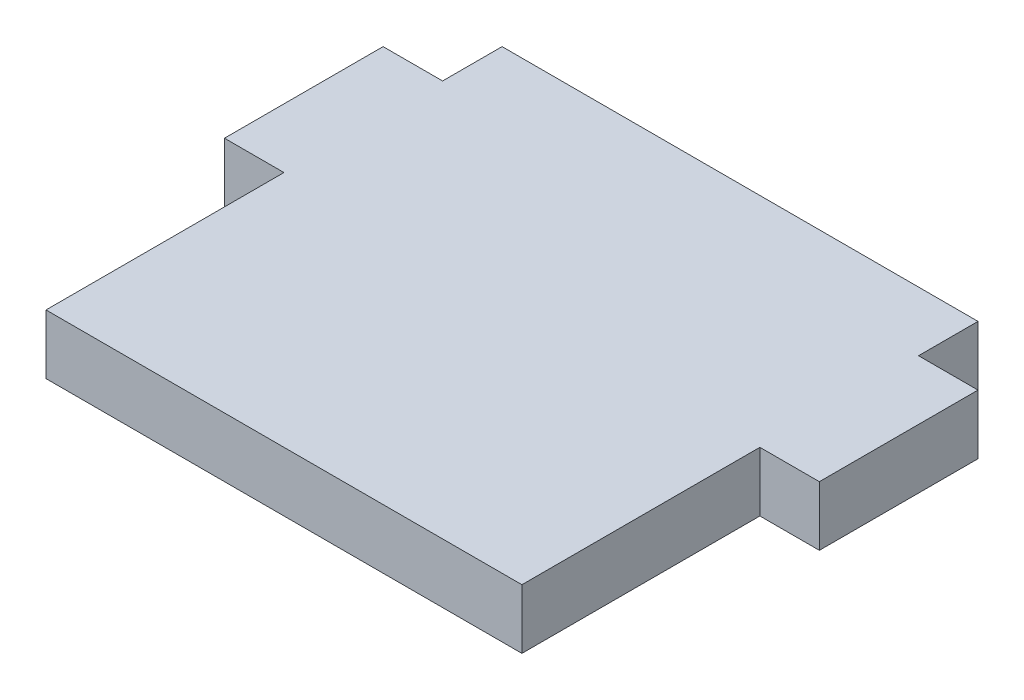
ISO-10303-21;
HEADER;
FILE_DESCRIPTION(('STEP AP214'),'2;1');
FILE_NAME('part.step','',(''),(''),'','','');
FILE_SCHEMA(('AUTOMOTIVE_DESIGN { 1 0 10303 214 1 1 1 1 }'));
ENDSEC;
DATA;
#1=APPLICATION_CONTEXT('core data for automotive mechanical design processes');
#2=APPLICATION_PROTOCOL_DEFINITION('international standard','automotive_design',2000,#1);
#3=PRODUCT_CONTEXT('',#1,'mechanical');
#4=PRODUCT('Part','Part','',(#3));
#5=PRODUCT_RELATED_PRODUCT_CATEGORY('part','',(#4));
#6=PRODUCT_DEFINITION_FORMATION('','',#4);
#7=PRODUCT_DEFINITION_CONTEXT('part definition',#1,'design');
#8=PRODUCT_DEFINITION('design','',#6,#7);
#9=PRODUCT_DEFINITION_SHAPE('','',#8);
#10=(LENGTH_UNIT() NAMED_UNIT(*) SI_UNIT(.MILLI.,.METRE.));
#11=(NAMED_UNIT(*) PLANE_ANGLE_UNIT() SI_UNIT($,.RADIAN.));
#12=(NAMED_UNIT(*) SI_UNIT($,.STERADIAN.) SOLID_ANGLE_UNIT());
#13=UNCERTAINTY_MEASURE_WITH_UNIT(LENGTH_MEASURE(1.E-05),#10,'distance_accuracy_value','');
#14=(GEOMETRIC_REPRESENTATION_CONTEXT(3) GLOBAL_UNCERTAINTY_ASSIGNED_CONTEXT((#13)) GLOBAL_UNIT_ASSIGNED_CONTEXT((#10,
#11,#12)) REPRESENTATION_CONTEXT('',''));
#15=CARTESIAN_POINT('',(0.,0.,0.));
#16=DIRECTION('',(0.,0.,1.));
#17=DIRECTION('',(1.,0.,0.));
#18=AXIS2_PLACEMENT_3D('',#15,#16,#17);
#19=CARTESIAN_POINT('',(0.,19.05,-76.2));
#20=DIRECTION('',(1.,0.,0.));
#21=DIRECTION('',(0.,0.,-1.));
#22=AXIS2_PLACEMENT_3D('',#19,#20,#21);
#23=PLANE('',#22);
#24=DIRECTION('',(0.,0.,1.));
#25=VECTOR('',#24,1.);
#26=CARTESIAN_POINT('',(0.,0.,-76.2));
#27=LINE('',#26,#25);
#28=CARTESIAN_POINT('',(0.,0.,-76.2));
#29=VERTEX_POINT('',#28);
#30=CARTESIAN_POINT('',(0.,0.,0.));
#31=VERTEX_POINT('',#30);
#32=EDGE_CURVE('E155',#29,#31,#27,.T.);
#33=ORIENTED_EDGE('',*,*,#32,.T.);
#34=DIRECTION('',(0.,-1.,0.));
#35=VECTOR('',#34,1.);
#36=CARTESIAN_POINT('',(0.,19.05,0.));
#37=LINE('',#36,#35);
#38=CARTESIAN_POINT('',(0.,19.05,0.));
#39=VERTEX_POINT('',#38);
#40=EDGE_CURVE('E11',#39,#31,#37,.T.);
#41=ORIENTED_EDGE('',*,*,#40,.F.);
#42=DIRECTION('',(0.,0.,1.));
#43=VECTOR('',#42,1.);
#44=CARTESIAN_POINT('',(0.,19.05,-76.2));
#45=LINE('',#44,#43);
#46=CARTESIAN_POINT('',(0.,19.05,-76.2));
#47=VERTEX_POINT('',#46);
#48=EDGE_CURVE('E177',#47,#39,#45,.T.);
#49=ORIENTED_EDGE('',*,*,#48,.F.);
#50=DIRECTION('',(0.,-1.,0.));
#51=VECTOR('',#50,1.);
#52=CARTESIAN_POINT('',(0.,19.05,-76.2));
#53=LINE('',#52,#51);
#54=EDGE_CURVE('E151',#47,#29,#53,.T.);
#55=ORIENTED_EDGE('',*,*,#54,.T.);
#56=EDGE_LOOP('',(#33,#41,#49,#55));
#57=FACE_BOUND('',#56,.T.);
#58=ADVANCED_FACE('F35',(#57),#23,.F.);
#59=CARTESIAN_POINT('',(0.,19.05,0.));
#60=DIRECTION('',(0.,0.,-1.));
#61=DIRECTION('',(-1.,0.,0.));
#62=AXIS2_PLACEMENT_3D('',#59,#60,#61);
#63=PLANE('',#62);
#64=DIRECTION('',(1.,0.,0.));
#65=VECTOR('',#64,1.);
#66=CARTESIAN_POINT('',(0.,0.,0.));
#67=LINE('',#66,#65);
#68=CARTESIAN_POINT('',(152.4,0.,0.));
#69=VERTEX_POINT('',#68);
#70=EDGE_CURVE('E158',#31,#69,#67,.T.);
#71=ORIENTED_EDGE('',*,*,#70,.T.);
#72=DIRECTION('',(0.,-1.,0.));
#73=VECTOR('',#72,1.);
#74=CARTESIAN_POINT('',(152.4,19.05,0.));
#75=LINE('',#74,#73);
#76=CARTESIAN_POINT('',(152.4,19.05,0.));
#77=VERTEX_POINT('',#76);
#78=EDGE_CURVE('E43',#77,#69,#75,.T.);
#79=ORIENTED_EDGE('',*,*,#78,.F.);
#80=DIRECTION('',(1.,0.,0.));
#81=VECTOR('',#80,1.);
#82=CARTESIAN_POINT('',(0.,19.05,0.));
#83=LINE('',#82,#81);
#84=EDGE_CURVE('E106',#39,#77,#83,.T.);
#85=ORIENTED_EDGE('',*,*,#84,.F.);
#86=ORIENTED_EDGE('',*,*,#40,.T.);
#87=EDGE_LOOP('',(#71,#79,#85,#86));
#88=FACE_BOUND('',#87,.T.);
#89=ADVANCED_FACE('F255',(#88),#63,.F.);
#90=CARTESIAN_POINT('',(152.4,19.05,0.));
#91=DIRECTION('',(-1.,0.,0.));
#92=DIRECTION('',(0.,0.,1.));
#93=AXIS2_PLACEMENT_3D('',#90,#91,#92);
#94=PLANE('',#93);
#95=DIRECTION('',(0.,0.,-1.));
#96=VECTOR('',#95,1.);
#97=CARTESIAN_POINT('',(152.4,0.,0.));
#98=LINE('',#97,#96);
#99=CARTESIAN_POINT('',(152.4,0.,-76.2));
#100=VERTEX_POINT('',#99);
#101=EDGE_CURVE('E160',#69,#100,#98,.T.);
#102=ORIENTED_EDGE('',*,*,#101,.T.);
#103=DIRECTION('',(0.,-1.,0.));
#104=VECTOR('',#103,1.);
#105=CARTESIAN_POINT('',(152.4,19.05,-76.2));
#106=LINE('',#105,#104);
#107=CARTESIAN_POINT('',(152.4,19.05,-76.2));
#108=VERTEX_POINT('',#107);
#109=EDGE_CURVE('E196',#108,#100,#106,.T.);
#110=ORIENTED_EDGE('',*,*,#109,.F.);
#111=DIRECTION('',(0.,0.,-1.));
#112=VECTOR('',#111,1.);
#113=CARTESIAN_POINT('',(152.4,19.05,0.));
#114=LINE('',#113,#112);
#115=EDGE_CURVE('E204',#77,#108,#114,.T.);
#116=ORIENTED_EDGE('',*,*,#115,.F.);
#117=ORIENTED_EDGE('',*,*,#78,.T.);
#118=EDGE_LOOP('',(#102,#110,#116,#117));
#119=FACE_BOUND('',#118,.T.);
#120=ADVANCED_FACE('F202',(#119),#94,.F.);
#121=CARTESIAN_POINT('',(152.4,19.05,-76.2));
#122=DIRECTION('',(0.,0.,-1.));
#123=DIRECTION('',(-1.,0.,0.));
#124=AXIS2_PLACEMENT_3D('',#121,#122,#123);
#125=PLANE('',#124);
#126=DIRECTION('',(1.,0.,0.));
#127=VECTOR('',#126,1.);
#128=CARTESIAN_POINT('',(152.4,0.,-76.2));
#129=LINE('',#128,#127);
#130=CARTESIAN_POINT('',(171.45,0.,-76.2));
#131=VERTEX_POINT('',#130);
#132=EDGE_CURVE('E162',#100,#131,#129,.T.);
#133=ORIENTED_EDGE('',*,*,#132,.T.);
#134=DIRECTION('',(0.,-1.,0.));
#135=VECTOR('',#134,1.);
#136=CARTESIAN_POINT('',(171.45,19.05,-76.2));
#137=LINE('',#136,#135);
#138=CARTESIAN_POINT('',(171.45,19.05,-76.2));
#139=VERTEX_POINT('',#138);
#140=EDGE_CURVE('E193',#139,#131,#137,.T.);
#141=ORIENTED_EDGE('',*,*,#140,.F.);
#142=DIRECTION('',(1.,0.,0.));
#143=VECTOR('',#142,1.);
#144=CARTESIAN_POINT('',(152.4,19.05,-76.2));
#145=LINE('',#144,#143);
#146=EDGE_CURVE('E222',#108,#139,#145,.T.);
#147=ORIENTED_EDGE('',*,*,#146,.F.);
#148=ORIENTED_EDGE('',*,*,#109,.T.);
#149=EDGE_LOOP('',(#133,#141,#147,#148));
#150=FACE_BOUND('',#149,.T.);
#151=ADVANCED_FACE('F213',(#150),#125,.F.);
#152=CARTESIAN_POINT('',(171.45,19.05,-76.2));
#153=DIRECTION('',(-1.,0.,0.));
#154=DIRECTION('',(0.,0.,1.));
#155=AXIS2_PLACEMENT_3D('',#152,#153,#154);
#156=PLANE('',#155);
#157=DIRECTION('',(0.,0.,-1.));
#158=VECTOR('',#157,1.);
#159=CARTESIAN_POINT('',(171.45,0.,-76.2));
#160=LINE('',#159,#158);
#161=CARTESIAN_POINT('',(171.45,0.,-127.));
#162=VERTEX_POINT('',#161);
#163=EDGE_CURVE('E164',#131,#162,#160,.T.);
#164=ORIENTED_EDGE('',*,*,#163,.T.);
#165=DIRECTION('',(0.,-1.,0.));
#166=VECTOR('',#165,1.);
#167=CARTESIAN_POINT('',(171.45,19.05,-127.));
#168=LINE('',#167,#166);
#169=CARTESIAN_POINT('',(171.45,19.05,-127.));
#170=VERTEX_POINT('',#169);
#171=EDGE_CURVE('E190',#170,#162,#168,.T.);
#172=ORIENTED_EDGE('',*,*,#171,.F.);
#173=DIRECTION('',(0.,0.,-1.));
#174=VECTOR('',#173,1.);
#175=CARTESIAN_POINT('',(171.45,19.05,-76.2));
#176=LINE('',#175,#174);
#177=EDGE_CURVE('E219',#139,#170,#176,.T.);
#178=ORIENTED_EDGE('',*,*,#177,.F.);
#179=ORIENTED_EDGE('',*,*,#140,.T.);
#180=EDGE_LOOP('',(#164,#172,#178,#179));
#181=FACE_BOUND('',#180,.T.);
#182=ADVANCED_FACE('F217',(#181),#156,.F.);
#183=CARTESIAN_POINT('',(171.45,19.05,-127.));
#184=DIRECTION('',(0.,0.,1.));
#185=DIRECTION('',(1.,0.,0.));
#186=AXIS2_PLACEMENT_3D('',#183,#184,#185);
#187=PLANE('',#186);
#188=DIRECTION('',(-1.,0.,0.));
#189=VECTOR('',#188,1.);
#190=CARTESIAN_POINT('',(171.45,0.,-127.));
#191=LINE('',#190,#189);
#192=CARTESIAN_POINT('',(152.4,0.,-127.));
#193=VERTEX_POINT('',#192);
#194=EDGE_CURVE('E166',#162,#193,#191,.T.);
#195=ORIENTED_EDGE('',*,*,#194,.T.);
#196=DIRECTION('',(0.,-1.,0.));
#197=VECTOR('',#196,1.);
#198=CARTESIAN_POINT('',(152.4,19.05,-127.));
#199=LINE('',#198,#197);
#200=CARTESIAN_POINT('',(152.4,19.05,-127.));
#201=VERTEX_POINT('',#200);
#202=EDGE_CURVE('E187',#201,#193,#199,.T.);
#203=ORIENTED_EDGE('',*,*,#202,.F.);
#204=DIRECTION('',(-1.,0.,0.));
#205=VECTOR('',#204,1.);
#206=CARTESIAN_POINT('',(171.45,19.05,-127.));
#207=LINE('',#206,#205);
#208=EDGE_CURVE('E221',#170,#201,#207,.T.);
#209=ORIENTED_EDGE('',*,*,#208,.F.);
#210=ORIENTED_EDGE('',*,*,#171,.T.);
#211=EDGE_LOOP('',(#195,#203,#209,#210));
#212=FACE_BOUND('',#211,.T.);
#213=ADVANCED_FACE('F268',(#212),#187,.F.);
#214=CARTESIAN_POINT('',(152.4,19.05,-127.));
#215=DIRECTION('',(-1.,0.,0.));
#216=DIRECTION('',(0.,0.,1.));
#217=AXIS2_PLACEMENT_3D('',#214,#215,#216);
#218=PLANE('',#217);
#219=DIRECTION('',(0.,0.,-1.));
#220=VECTOR('',#219,1.);
#221=CARTESIAN_POINT('',(152.4,0.,-127.));
#222=LINE('',#221,#220);
#223=CARTESIAN_POINT('',(152.4,0.,-146.05));
#224=VERTEX_POINT('',#223);
#225=EDGE_CURVE('E168',#193,#224,#222,.T.);
#226=ORIENTED_EDGE('',*,*,#225,.T.);
#227=DIRECTION('',(0.,-1.,0.));
#228=VECTOR('',#227,1.);
#229=CARTESIAN_POINT('',(152.4,19.05,-146.05));
#230=LINE('',#229,#228);
#231=CARTESIAN_POINT('',(152.4,19.05,-146.05));
#232=VERTEX_POINT('',#231);
#233=EDGE_CURVE('E184',#232,#224,#230,.T.);
#234=ORIENTED_EDGE('',*,*,#233,.F.);
#235=DIRECTION('',(0.,0.,-1.));
#236=VECTOR('',#235,1.);
#237=CARTESIAN_POINT('',(152.4,19.05,-127.));
#238=LINE('',#237,#236);
#239=EDGE_CURVE('E224',#201,#232,#238,.T.);
#240=ORIENTED_EDGE('',*,*,#239,.F.);
#241=ORIENTED_EDGE('',*,*,#202,.T.);
#242=EDGE_LOOP('',(#226,#234,#240,#241));
#243=FACE_BOUND('',#242,.T.);
#244=ADVANCED_FACE('F271',(#243),#218,.F.);
#245=CARTESIAN_POINT('',(152.4,19.05,-146.05));
#246=DIRECTION('',(0.,0.,1.));
#247=DIRECTION('',(1.,0.,0.));
#248=AXIS2_PLACEMENT_3D('',#245,#246,#247);
#249=PLANE('',#248);
#250=DIRECTION('',(-1.,0.,0.));
#251=VECTOR('',#250,1.);
#252=CARTESIAN_POINT('',(152.4,0.,-146.05));
#253=LINE('',#252,#251);
#254=CARTESIAN_POINT('',(0.,0.,-146.05));
#255=VERTEX_POINT('',#254);
#256=EDGE_CURVE('E170',#224,#255,#253,.T.);
#257=ORIENTED_EDGE('',*,*,#256,.T.);
#258=DIRECTION('',(0.,-1.,0.));
#259=VECTOR('',#258,1.);
#260=CARTESIAN_POINT('',(0.,19.05,-146.05));
#261=LINE('',#260,#259);
#262=CARTESIAN_POINT('',(0.,19.05,-146.05));
#263=VERTEX_POINT('',#262);
#264=EDGE_CURVE('E181',#263,#255,#261,.T.);
#265=ORIENTED_EDGE('',*,*,#264,.F.);
#266=DIRECTION('',(-1.,0.,0.));
#267=VECTOR('',#266,1.);
#268=CARTESIAN_POINT('',(152.4,19.05,-146.05));
#269=LINE('',#268,#267);
#270=EDGE_CURVE('E230',#232,#263,#269,.T.);
#271=ORIENTED_EDGE('',*,*,#270,.F.);
#272=ORIENTED_EDGE('',*,*,#233,.T.);
#273=EDGE_LOOP('',(#257,#265,#271,#272));
#274=FACE_BOUND('',#273,.T.);
#275=ADVANCED_FACE('F236',(#274),#249,.F.);
#276=CARTESIAN_POINT('',(0.,19.05,-146.05));
#277=DIRECTION('',(1.,0.,0.));
#278=DIRECTION('',(0.,0.,-1.));
#279=AXIS2_PLACEMENT_3D('',#276,#277,#278);
#280=PLANE('',#279);
#281=DIRECTION('',(0.,0.,1.));
#282=VECTOR('',#281,1.);
#283=CARTESIAN_POINT('',(0.,0.,-146.05));
#284=LINE('',#283,#282);
#285=CARTESIAN_POINT('',(0.,0.,-127.));
#286=VERTEX_POINT('',#285);
#287=EDGE_CURVE('E172',#255,#286,#284,.T.);
#288=ORIENTED_EDGE('',*,*,#287,.T.);
#289=DIRECTION('',(0.,-1.,0.));
#290=VECTOR('',#289,1.);
#291=CARTESIAN_POINT('',(0.,19.05,-127.));
#292=LINE('',#291,#290);
#293=CARTESIAN_POINT('',(0.,19.05,-127.));
#294=VERTEX_POINT('',#293);
#295=EDGE_CURVE('E146',#294,#286,#292,.T.);
#296=ORIENTED_EDGE('',*,*,#295,.F.);
#297=DIRECTION('',(0.,0.,1.));
#298=VECTOR('',#297,1.);
#299=CARTESIAN_POINT('',(0.,19.05,-146.05));
#300=LINE('',#299,#298);
#301=EDGE_CURVE('E137',#263,#294,#300,.T.);
#302=ORIENTED_EDGE('',*,*,#301,.F.);
#303=ORIENTED_EDGE('',*,*,#264,.T.);
#304=EDGE_LOOP('',(#288,#296,#302,#303));
#305=FACE_BOUND('',#304,.T.);
#306=ADVANCED_FACE('F240',(#305),#280,.F.);
#307=CARTESIAN_POINT('',(0.,19.05,-127.));
#308=DIRECTION('',(0.,0.,1.));
#309=DIRECTION('',(1.,0.,0.));
#310=AXIS2_PLACEMENT_3D('',#307,#308,#309);
#311=PLANE('',#310);
#312=DIRECTION('',(-1.,0.,0.));
#313=VECTOR('',#312,1.);
#314=CARTESIAN_POINT('',(0.,0.,-127.));
#315=LINE('',#314,#313);
#316=CARTESIAN_POINT('',(-19.05,0.,-127.));
#317=VERTEX_POINT('',#316);
#318=EDGE_CURVE('E145',#286,#317,#315,.T.);
#319=ORIENTED_EDGE('',*,*,#318,.T.);
#320=DIRECTION('',(0.,-1.,0.));
#321=VECTOR('',#320,1.);
#322=CARTESIAN_POINT('',(-19.05,19.05,-127.));
#323=LINE('',#322,#321);
#324=CARTESIAN_POINT('',(-19.05,19.05,-127.));
#325=VERTEX_POINT('',#324);
#326=EDGE_CURVE('E142',#325,#317,#323,.T.);
#327=ORIENTED_EDGE('',*,*,#326,.F.);
#328=DIRECTION('',(-1.,0.,0.));
#329=VECTOR('',#328,1.);
#330=CARTESIAN_POINT('',(0.,19.05,-127.));
#331=LINE('',#330,#329);
#332=EDGE_CURVE('E131',#294,#325,#331,.T.);
#333=ORIENTED_EDGE('',*,*,#332,.F.);
#334=ORIENTED_EDGE('',*,*,#295,.T.);
#335=EDGE_LOOP('',(#319,#327,#333,#334));
#336=FACE_BOUND('',#335,.T.);
#337=ADVANCED_FACE('F143',(#336),#311,.F.);
#338=CARTESIAN_POINT('',(-19.05,19.05,-127.));
#339=DIRECTION('',(1.,0.,0.));
#340=DIRECTION('',(0.,0.,-1.));
#341=AXIS2_PLACEMENT_3D('',#338,#339,#340);
#342=PLANE('',#341);
#343=DIRECTION('',(0.,0.,1.));
#344=VECTOR('',#343,1.);
#345=CARTESIAN_POINT('',(-19.05,0.,-127.));
#346=LINE('',#345,#344);
#347=CARTESIAN_POINT('',(-19.05,0.,-76.2));
#348=VERTEX_POINT('',#347);
#349=EDGE_CURVE('E92',#317,#348,#346,.T.);
#350=ORIENTED_EDGE('',*,*,#349,.T.);
#351=DIRECTION('',(0.,-1.,0.));
#352=VECTOR('',#351,1.);
#353=CARTESIAN_POINT('',(-19.05,19.05,-76.2));
#354=LINE('',#353,#352);
#355=CARTESIAN_POINT('',(-19.05,19.05,-76.2));
#356=VERTEX_POINT('',#355);
#357=EDGE_CURVE('E147',#356,#348,#354,.T.);
#358=ORIENTED_EDGE('',*,*,#357,.F.);
#359=DIRECTION('',(0.,0.,1.));
#360=VECTOR('',#359,1.);
#361=CARTESIAN_POINT('',(-19.05,19.05,-127.));
#362=LINE('',#361,#360);
#363=EDGE_CURVE('E135',#325,#356,#362,.T.);
#364=ORIENTED_EDGE('',*,*,#363,.F.);
#365=ORIENTED_EDGE('',*,*,#326,.T.);
#366=EDGE_LOOP('',(#350,#358,#364,#365));
#367=FACE_BOUND('',#366,.T.);
#368=ADVANCED_FACE('F149',(#367),#342,.F.);
#369=CARTESIAN_POINT('',(-19.05,19.05,-76.2));
#370=DIRECTION('',(0.,0.,-1.));
#371=DIRECTION('',(-1.,0.,0.));
#372=AXIS2_PLACEMENT_3D('',#369,#370,#371);
#373=PLANE('',#372);
#374=DIRECTION('',(1.,0.,0.));
#375=VECTOR('',#374,1.);
#376=CARTESIAN_POINT('',(-19.05,0.,-76.2));
#377=LINE('',#376,#375);
#378=EDGE_CURVE('E98',#348,#29,#377,.T.);
#379=ORIENTED_EDGE('',*,*,#378,.T.);
#380=ORIENTED_EDGE('',*,*,#54,.F.);
#381=DIRECTION('',(1.,0.,0.));
#382=VECTOR('',#381,1.);
#383=CARTESIAN_POINT('',(-19.05,19.05,-76.2));
#384=LINE('',#383,#382);
#385=EDGE_CURVE('E51',#356,#47,#384,.T.);
#386=ORIENTED_EDGE('',*,*,#385,.F.);
#387=ORIENTED_EDGE('',*,*,#357,.T.);
#388=EDGE_LOOP('',(#379,#380,#386,#387));
#389=FACE_BOUND('',#388,.T.);
#390=ADVANCED_FACE('F244',(#389),#373,.F.);
#391=CARTESIAN_POINT('',(0.,19.05,0.));
#392=DIRECTION('',(0.,1.,0.));
#393=DIRECTION('',(0.,0.,1.));
#394=AXIS2_PLACEMENT_3D('',#391,#392,#393);
#395=PLANE('',#394);
#396=ORIENTED_EDGE('',*,*,#48,.T.);
#397=ORIENTED_EDGE('',*,*,#84,.T.);
#398=ORIENTED_EDGE('',*,*,#115,.T.);
#399=ORIENTED_EDGE('',*,*,#146,.T.);
#400=ORIENTED_EDGE('',*,*,#177,.T.);
#401=ORIENTED_EDGE('',*,*,#208,.T.);
#402=ORIENTED_EDGE('',*,*,#239,.T.);
#403=ORIENTED_EDGE('',*,*,#270,.T.);
#404=ORIENTED_EDGE('',*,*,#301,.T.);
#405=ORIENTED_EDGE('',*,*,#332,.T.);
#406=ORIENTED_EDGE('',*,*,#363,.T.);
#407=ORIENTED_EDGE('',*,*,#385,.T.);
#408=EDGE_LOOP('',(#396,#397,#398,#399,#400,#401,#402,#403,#404,#405,#406,#407));
#409=FACE_BOUND('',#408,.T.);
#410=ADVANCED_FACE('F133',(#409),#395,.T.);
#411=CARTESIAN_POINT('',(0.,0.,0.));
#412=DIRECTION('',(0.,1.,0.));
#413=DIRECTION('',(0.,0.,1.));
#414=AXIS2_PLACEMENT_3D('',#411,#412,#413);
#415=PLANE('',#414);
#416=ORIENTED_EDGE('',*,*,#32,.F.);
#417=ORIENTED_EDGE('',*,*,#378,.F.);
#418=ORIENTED_EDGE('',*,*,#349,.F.);
#419=ORIENTED_EDGE('',*,*,#318,.F.);
#420=ORIENTED_EDGE('',*,*,#287,.F.);
#421=ORIENTED_EDGE('',*,*,#256,.F.);
#422=ORIENTED_EDGE('',*,*,#225,.F.);
#423=ORIENTED_EDGE('',*,*,#194,.F.);
#424=ORIENTED_EDGE('',*,*,#163,.F.);
#425=ORIENTED_EDGE('',*,*,#132,.F.);
#426=ORIENTED_EDGE('',*,*,#101,.F.);
#427=ORIENTED_EDGE('',*,*,#70,.F.);
#428=EDGE_LOOP('',(#416,#417,#418,#419,#420,#421,#422,#423,#424,#425,#426,#427));
#429=FACE_BOUND('',#428,.T.);
#430=ADVANCED_FACE('F208',(#429),#415,.F.);
#431=CLOSED_SHELL('',(#58,#89,#120,#151,#182,#213,#244,#275,#306,#337,#368,#390,#410,#430));
#432=MANIFOLD_SOLID_BREP('B2',#431);
#433=ADVANCED_BREP_SHAPE_REPRESENTATION('',(#18,#432),#14);
#434=SHAPE_DEFINITION_REPRESENTATION(#9,#433);
ENDSEC;
END-ISO-10303-21;
